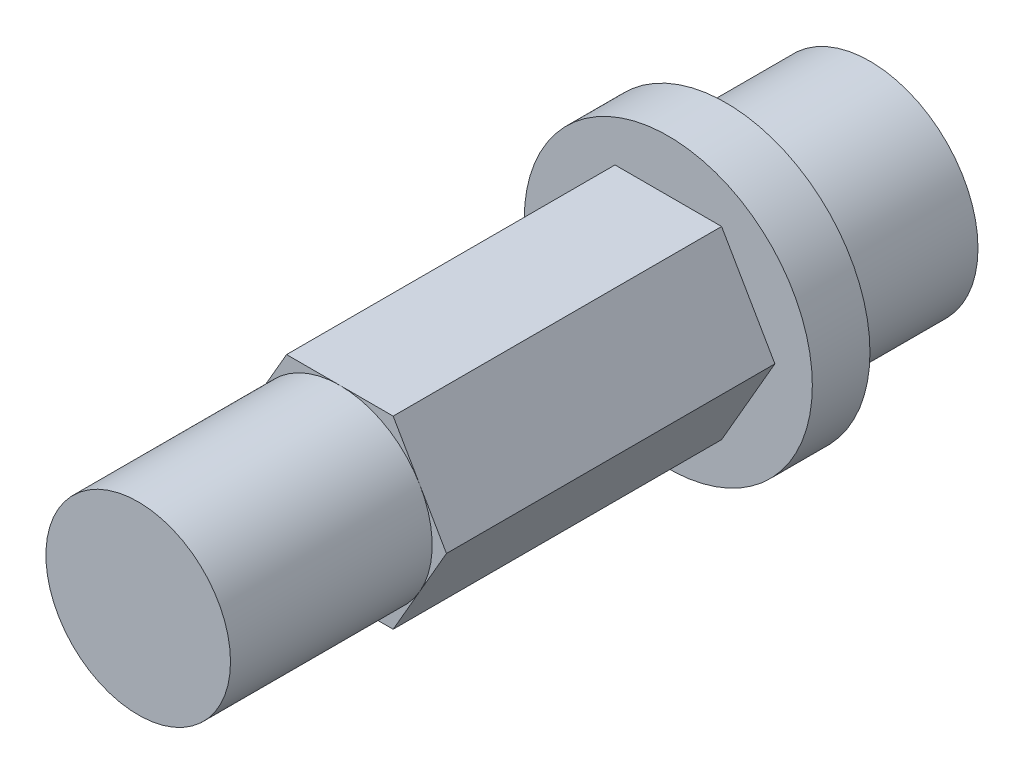
ISO-10303-21;
HEADER;
FILE_DESCRIPTION(('STEP AP214'),'2;1');
FILE_NAME('part.step','',(''),(''),'','','');
FILE_SCHEMA(('AUTOMOTIVE_DESIGN { 1 0 10303 214 1 1 1 1 }'));
ENDSEC;
DATA;
#1=APPLICATION_CONTEXT('core data for automotive mechanical design processes');
#2=APPLICATION_PROTOCOL_DEFINITION('international standard','automotive_design',2000,#1);
#3=PRODUCT_CONTEXT('',#1,'mechanical');
#4=PRODUCT('Part','Part','',(#3));
#5=PRODUCT_RELATED_PRODUCT_CATEGORY('part','',(#4));
#6=PRODUCT_DEFINITION_FORMATION('','',#4);
#7=PRODUCT_DEFINITION_CONTEXT('part definition',#1,'design');
#8=PRODUCT_DEFINITION('design','',#6,#7);
#9=PRODUCT_DEFINITION_SHAPE('','',#8);
#10=(LENGTH_UNIT() NAMED_UNIT(*) SI_UNIT(.MILLI.,.METRE.));
#11=(NAMED_UNIT(*) PLANE_ANGLE_UNIT() SI_UNIT($,.RADIAN.));
#12=(NAMED_UNIT(*) SI_UNIT($,.STERADIAN.) SOLID_ANGLE_UNIT());
#13=UNCERTAINTY_MEASURE_WITH_UNIT(LENGTH_MEASURE(1.E-05),#10,'distance_accuracy_value','');
#14=(GEOMETRIC_REPRESENTATION_CONTEXT(3) GLOBAL_UNCERTAINTY_ASSIGNED_CONTEXT((#13)) GLOBAL_UNIT_ASSIGNED_CONTEXT((#10,
#11,#12)) REPRESENTATION_CONTEXT('',''));
#15=CARTESIAN_POINT('',(0.,0.,0.));
#16=DIRECTION('',(0.,0.,1.));
#17=DIRECTION('',(1.,0.,0.));
#18=AXIS2_PLACEMENT_3D('',#15,#16,#17);
#19=CARTESIAN_POINT('',(0.,0.,18.4));
#20=DIRECTION('',(0.,0.,1.));
#21=DIRECTION('',(1.,0.,0.));
#22=AXIS2_PLACEMENT_3D('',#19,#20,#21);
#23=PLANE('',#22);
#24=CARTESIAN_POINT('',(0.,0.,18.4));
#25=DIRECTION('',(0.,0.,1.));
#26=DIRECTION('',(1.,0.,0.));
#27=AXIS2_PLACEMENT_3D('',#24,#25,#26);
#28=CIRCLE('',#27,3.20429399400242);
#29=CARTESIAN_POINT('',(2.775,1.60214699700121,18.4));
#30=VERTEX_POINT('',#29);
#31=CARTESIAN_POINT('',(0.,3.20429399400243,18.4));
#32=VERTEX_POINT('',#31);
#33=EDGE_CURVE('E51',#30,#32,#28,.T.);
#34=ORIENTED_EDGE('',*,*,#33,.F.);
#35=DIRECTION('',(-0.5,0.866025403784439,0.));
#36=VECTOR('',#35,1.);
#37=CARTESIAN_POINT('',(3.7,0.,18.4));
#38=LINE('',#37,#36);
#39=CARTESIAN_POINT('',(1.85,3.20429399400242,18.4));
#40=VERTEX_POINT('',#39);
#41=EDGE_CURVE('E127',#30,#40,#38,.T.);
#42=ORIENTED_EDGE('',*,*,#41,.T.);
#43=DIRECTION('',(-1.,0.,0.));
#44=VECTOR('',#43,1.);
#45=CARTESIAN_POINT('',(1.85,3.20429399400242,18.4));
#46=LINE('',#45,#44);
#47=EDGE_CURVE('E141',#40,#32,#46,.T.);
#48=ORIENTED_EDGE('',*,*,#47,.T.);
#49=EDGE_LOOP('',(#34,#42,#48));
#50=FACE_BOUND('',#49,.T.);
#51=ADVANCED_FACE('F39',(#50),#23,.T.);
#52=CARTESIAN_POINT('',(-2.775,1.60214699700121,18.4));
#53=VERTEX_POINT('',#52);
#54=EDGE_CURVE('E11',#32,#53,#28,.T.);
#55=ORIENTED_EDGE('',*,*,#54,.F.);
#56=CARTESIAN_POINT('',(-1.85,3.20429399400243,18.4));
#57=VERTEX_POINT('',#56);
#58=EDGE_CURVE('E126',#32,#57,#46,.T.);
#59=ORIENTED_EDGE('',*,*,#58,.T.);
#60=DIRECTION('',(-0.5,-0.866025403784439,0.));
#61=VECTOR('',#60,1.);
#62=CARTESIAN_POINT('',(-1.85,3.20429399400243,18.4));
#63=LINE('',#62,#61);
#64=EDGE_CURVE('E158',#57,#53,#63,.T.);
#65=ORIENTED_EDGE('',*,*,#64,.T.);
#66=EDGE_LOOP('',(#55,#59,#65));
#67=FACE_BOUND('',#66,.T.);
#68=ADVANCED_FACE('F242',(#67),#23,.T.);
#69=CARTESIAN_POINT('',(-2.775,-1.60214699700121,18.4));
#70=VERTEX_POINT('',#69);
#71=EDGE_CURVE('E49',#53,#70,#28,.T.);
#72=ORIENTED_EDGE('',*,*,#71,.F.);
#73=CARTESIAN_POINT('',(-3.7,0.,18.4));
#74=VERTEX_POINT('',#73);
#75=EDGE_CURVE('E157',#53,#74,#63,.T.);
#76=ORIENTED_EDGE('',*,*,#75,.T.);
#77=DIRECTION('',(0.5,-0.866025403784439,0.));
#78=VECTOR('',#77,1.);
#79=CARTESIAN_POINT('',(-3.7,0.,18.4));
#80=LINE('',#79,#78);
#81=EDGE_CURVE('E163',#74,#70,#80,.T.);
#82=ORIENTED_EDGE('',*,*,#81,.T.);
#83=EDGE_LOOP('',(#72,#76,#82));
#84=FACE_BOUND('',#83,.T.);
#85=ADVANCED_FACE('F247',(#84),#23,.T.);
#86=CARTESIAN_POINT('',(0.,-3.20429399400242,18.4));
#87=VERTEX_POINT('',#86);
#88=EDGE_CURVE('E66',#70,#87,#28,.T.);
#89=ORIENTED_EDGE('',*,*,#88,.F.);
#90=CARTESIAN_POINT('',(-1.85,-3.20429399400242,18.4));
#91=VERTEX_POINT('',#90);
#92=EDGE_CURVE('E162',#70,#91,#80,.T.);
#93=ORIENTED_EDGE('',*,*,#92,.T.);
#94=DIRECTION('',(1.,0.,0.));
#95=VECTOR('',#94,1.);
#96=CARTESIAN_POINT('',(-1.85,-3.20429399400242,18.4));
#97=LINE('',#96,#95);
#98=EDGE_CURVE('E168',#91,#87,#97,.T.);
#99=ORIENTED_EDGE('',*,*,#98,.T.);
#100=EDGE_LOOP('',(#89,#93,#99));
#101=FACE_BOUND('',#100,.T.);
#102=ADVANCED_FACE('F263',(#101),#23,.T.);
#103=CARTESIAN_POINT('',(2.775,-1.60214699700121,18.4));
#104=VERTEX_POINT('',#103);
#105=EDGE_CURVE('E58',#87,#104,#28,.T.);
#106=ORIENTED_EDGE('',*,*,#105,.F.);
#107=CARTESIAN_POINT('',(1.85,-3.20429399400243,18.4));
#108=VERTEX_POINT('',#107);
#109=EDGE_CURVE('E167',#87,#108,#97,.T.);
#110=ORIENTED_EDGE('',*,*,#109,.T.);
#111=DIRECTION('',(0.5,0.866025403784439,0.));
#112=VECTOR('',#111,1.);
#113=CARTESIAN_POINT('',(1.85,-3.20429399400243,18.4));
#114=LINE('',#113,#112);
#115=EDGE_CURVE('E139',#108,#104,#114,.T.);
#116=ORIENTED_EDGE('',*,*,#115,.T.);
#117=EDGE_LOOP('',(#106,#110,#116));
#118=FACE_BOUND('',#117,.T.);
#119=ADVANCED_FACE('F253',(#118),#23,.T.);
#120=CARTESIAN_POINT('',(0.,0.,5.));
#121=DIRECTION('',(0.,0.,-1.));
#122=DIRECTION('',(-1.,0.,0.));
#123=AXIS2_PLACEMENT_3D('',#120,#121,#122);
#124=CYLINDRICAL_SURFACE('',#123,3.75);
#125=CARTESIAN_POINT('',(0.,0.,5.));
#126=DIRECTION('',(0.,0.,1.));
#127=DIRECTION('',(1.,0.,0.));
#128=AXIS2_PLACEMENT_3D('',#125,#126,#127);
#129=CIRCLE('',#128,3.75);
#130=CARTESIAN_POINT('',(3.75,0.,5.));
#131=VERTEX_POINT('',#130);
#132=EDGE_CURVE('E147',#131,#131,#129,.T.);
#133=ORIENTED_EDGE('',*,*,#132,.F.);
#134=EDGE_LOOP('',(#133));
#135=FACE_BOUND('',#134,.T.);
#136=CARTESIAN_POINT('',(0.,0.,0.));
#137=DIRECTION('',(0.,0.,1.));
#138=DIRECTION('',(1.,0.,0.));
#139=AXIS2_PLACEMENT_3D('',#136,#137,#138);
#140=CIRCLE('',#139,3.75);
#141=CARTESIAN_POINT('',(3.75,0.,0.));
#142=VERTEX_POINT('',#141);
#143=EDGE_CURVE('E43',#142,#142,#140,.T.);
#144=ORIENTED_EDGE('',*,*,#143,.T.);
#145=EDGE_LOOP('',(#144));
#146=FACE_BOUND('',#145,.T.);
#147=ADVANCED_FACE('F41',(#135,#146),#124,.T.);
#148=CARTESIAN_POINT('',(0.,0.,0.));
#149=DIRECTION('',(0.,0.,1.));
#150=DIRECTION('',(1.,0.,0.));
#151=AXIS2_PLACEMENT_3D('',#148,#149,#150);
#152=PLANE('',#151);
#153=ORIENTED_EDGE('',*,*,#143,.F.);
#154=EDGE_LOOP('',(#153));
#155=FACE_BOUND('',#154,.T.);
#156=ADVANCED_FACE('F268',(#155),#152,.F.);
#157=CARTESIAN_POINT('',(0.,0.,7.));
#158=DIRECTION('',(0.,0.,-1.));
#159=DIRECTION('',(-1.,0.,0.));
#160=AXIS2_PLACEMENT_3D('',#157,#158,#159);
#161=CYLINDRICAL_SURFACE('',#160,5.);
#162=CARTESIAN_POINT('',(0.,0.,7.));
#163=DIRECTION('',(0.,0.,1.));
#164=DIRECTION('',(1.,0.,0.));
#165=AXIS2_PLACEMENT_3D('',#162,#163,#164);
#166=CIRCLE('',#165,5.);
#167=CARTESIAN_POINT('',(5.,0.,7.));
#168=VERTEX_POINT('',#167);
#169=EDGE_CURVE('E216',#168,#168,#166,.T.);
#170=ORIENTED_EDGE('',*,*,#169,.F.);
#171=EDGE_LOOP('',(#170));
#172=FACE_BOUND('',#171,.T.);
#173=CARTESIAN_POINT('',(0.,0.,5.));
#174=DIRECTION('',(0.,0.,1.));
#175=DIRECTION('',(1.,0.,0.));
#176=AXIS2_PLACEMENT_3D('',#173,#174,#175);
#177=CIRCLE('',#176,5.);
#178=CARTESIAN_POINT('',(5.,0.,5.));
#179=VERTEX_POINT('',#178);
#180=EDGE_CURVE('E215',#179,#179,#177,.T.);
#181=ORIENTED_EDGE('',*,*,#180,.T.);
#182=EDGE_LOOP('',(#181));
#183=FACE_BOUND('',#182,.T.);
#184=ADVANCED_FACE('F224',(#172,#183),#161,.T.);
#185=CARTESIAN_POINT('',(0.,0.,7.));
#186=DIRECTION('',(0.,0.,1.));
#187=DIRECTION('',(1.,0.,0.));
#188=AXIS2_PLACEMENT_3D('',#185,#186,#187);
#189=PLANE('',#188);
#190=DIRECTION('',(0.5,0.866025403784439,0.));
#191=VECTOR('',#190,1.);
#192=CARTESIAN_POINT('',(1.85,-3.20429399400243,7.));
#193=LINE('',#192,#191);
#194=CARTESIAN_POINT('',(1.85,-3.20429399400243,7.));
#195=VERTEX_POINT('',#194);
#196=CARTESIAN_POINT('',(3.7,0.,7.));
#197=VERTEX_POINT('',#196);
#198=EDGE_CURVE('E172',#195,#197,#193,.T.);
#199=ORIENTED_EDGE('',*,*,#198,.F.);
#200=DIRECTION('',(1.,0.,0.));
#201=VECTOR('',#200,1.);
#202=CARTESIAN_POINT('',(-1.85,-3.20429399400242,7.));
#203=LINE('',#202,#201);
#204=CARTESIAN_POINT('',(-1.85,-3.20429399400242,7.));
#205=VERTEX_POINT('',#204);
#206=EDGE_CURVE('E191',#205,#195,#203,.T.);
#207=ORIENTED_EDGE('',*,*,#206,.F.);
#208=DIRECTION('',(0.5,-0.866025403784439,0.));
#209=VECTOR('',#208,1.);
#210=CARTESIAN_POINT('',(-3.7,0.,7.));
#211=LINE('',#210,#209);
#212=CARTESIAN_POINT('',(-3.7,0.,7.));
#213=VERTEX_POINT('',#212);
#214=EDGE_CURVE('E187',#213,#205,#211,.T.);
#215=ORIENTED_EDGE('',*,*,#214,.F.);
#216=DIRECTION('',(-0.5,-0.866025403784439,0.));
#217=VECTOR('',#216,1.);
#218=CARTESIAN_POINT('',(-1.85,3.20429399400243,7.));
#219=LINE('',#218,#217);
#220=CARTESIAN_POINT('',(-1.85,3.20429399400243,7.));
#221=VERTEX_POINT('',#220);
#222=EDGE_CURVE('E183',#221,#213,#219,.T.);
#223=ORIENTED_EDGE('',*,*,#222,.F.);
#224=DIRECTION('',(-1.,0.,0.));
#225=VECTOR('',#224,1.);
#226=CARTESIAN_POINT('',(1.85,3.20429399400242,7.));
#227=LINE('',#226,#225);
#228=CARTESIAN_POINT('',(1.85,3.20429399400242,7.));
#229=VERTEX_POINT('',#228);
#230=EDGE_CURVE('E179',#229,#221,#227,.T.);
#231=ORIENTED_EDGE('',*,*,#230,.F.);
#232=DIRECTION('',(-0.5,0.866025403784439,0.));
#233=VECTOR('',#232,1.);
#234=CARTESIAN_POINT('',(3.7,0.,7.));
#235=LINE('',#234,#233);
#236=EDGE_CURVE('E176',#197,#229,#235,.T.);
#237=ORIENTED_EDGE('',*,*,#236,.F.);
#238=EDGE_LOOP('',(#199,#207,#215,#223,#231,#237));
#239=FACE_BOUND('',#238,.T.);
#240=ORIENTED_EDGE('',*,*,#169,.T.);
#241=EDGE_LOOP('',(#240));
#242=FACE_BOUND('',#241,.T.);
#243=ADVANCED_FACE('F229',(#239,#242),#189,.T.);
#244=CARTESIAN_POINT('',(0.,0.,5.));
#245=DIRECTION('',(0.,0.,1.));
#246=DIRECTION('',(1.,0.,0.));
#247=AXIS2_PLACEMENT_3D('',#244,#245,#246);
#248=PLANE('',#247);
#249=ORIENTED_EDGE('',*,*,#132,.T.);
#250=EDGE_LOOP('',(#249));
#251=FACE_BOUND('',#250,.T.);
#252=ORIENTED_EDGE('',*,*,#180,.F.);
#253=EDGE_LOOP('',(#252));
#254=FACE_BOUND('',#253,.T.);
#255=ADVANCED_FACE('F226',(#251,#254),#248,.F.);
#256=CARTESIAN_POINT('',(1.85,-3.20429399400243,18.4));
#257=DIRECTION('',(-0.866025403784439,0.5,0.));
#258=DIRECTION('',(-0.5,-0.866025403784439,0.));
#259=AXIS2_PLACEMENT_3D('',#256,#257,#258);
#260=PLANE('',#259);
#261=ORIENTED_EDGE('',*,*,#198,.T.);
#262=DIRECTION('',(0.,0.,-1.));
#263=VECTOR('',#262,1.);
#264=CARTESIAN_POINT('',(3.7,0.,18.4));
#265=LINE('',#264,#263);
#266=CARTESIAN_POINT('',(3.7,0.,18.4));
#267=VERTEX_POINT('',#266);
#268=EDGE_CURVE('E212',#267,#197,#265,.T.);
#269=ORIENTED_EDGE('',*,*,#268,.F.);
#270=EDGE_CURVE('E121',#104,#267,#114,.T.);
#271=ORIENTED_EDGE('',*,*,#270,.F.);
#272=ORIENTED_EDGE('',*,*,#115,.F.);
#273=DIRECTION('',(0.,0.,-1.));
#274=VECTOR('',#273,1.);
#275=CARTESIAN_POINT('',(1.85,-3.20429399400243,18.4));
#276=LINE('',#275,#274);
#277=EDGE_CURVE('E171',#108,#195,#276,.T.);
#278=ORIENTED_EDGE('',*,*,#277,.T.);
#279=EDGE_LOOP('',(#261,#269,#271,#272,#278));
#280=FACE_BOUND('',#279,.T.);
#281=ADVANCED_FACE('F228',(#280),#260,.F.);
#282=CARTESIAN_POINT('',(3.7,0.,18.4));
#283=DIRECTION('',(-0.866025403784439,-0.5,0.));
#284=DIRECTION('',(0.5,-0.866025403784439,0.));
#285=AXIS2_PLACEMENT_3D('',#282,#283,#284);
#286=PLANE('',#285);
#287=ORIENTED_EDGE('',*,*,#236,.T.);
#288=DIRECTION('',(0.,0.,-1.));
#289=VECTOR('',#288,1.);
#290=CARTESIAN_POINT('',(1.85,3.20429399400242,18.4));
#291=LINE('',#290,#289);
#292=EDGE_CURVE('E134',#40,#229,#291,.T.);
#293=ORIENTED_EDGE('',*,*,#292,.F.);
#294=ORIENTED_EDGE('',*,*,#41,.F.);
#295=EDGE_CURVE('E115',#267,#30,#38,.T.);
#296=ORIENTED_EDGE('',*,*,#295,.F.);
#297=ORIENTED_EDGE('',*,*,#268,.T.);
#298=EDGE_LOOP('',(#287,#293,#294,#296,#297));
#299=FACE_BOUND('',#298,.T.);
#300=ADVANCED_FACE('F132',(#299),#286,.F.);
#301=CARTESIAN_POINT('',(1.85,3.20429399400242,18.4));
#302=DIRECTION('',(0.,-1.,0.));
#303=DIRECTION('',(1.,0.,0.));
#304=AXIS2_PLACEMENT_3D('',#301,#302,#303);
#305=PLANE('',#304);
#306=ORIENTED_EDGE('',*,*,#230,.T.);
#307=DIRECTION('',(0.,0.,-1.));
#308=VECTOR('',#307,1.);
#309=CARTESIAN_POINT('',(-1.85,3.20429399400243,18.4));
#310=LINE('',#309,#308);
#311=EDGE_CURVE('E206',#57,#221,#310,.T.);
#312=ORIENTED_EDGE('',*,*,#311,.F.);
#313=ORIENTED_EDGE('',*,*,#58,.F.);
#314=ORIENTED_EDGE('',*,*,#47,.F.);
#315=ORIENTED_EDGE('',*,*,#292,.T.);
#316=EDGE_LOOP('',(#306,#312,#313,#314,#315));
#317=FACE_BOUND('',#316,.T.);
#318=ADVANCED_FACE('F289',(#317),#305,.F.);
#319=CARTESIAN_POINT('',(-1.85,3.20429399400243,18.4));
#320=DIRECTION('',(0.866025403784439,-0.5,0.));
#321=DIRECTION('',(0.5,0.866025403784439,0.));
#322=AXIS2_PLACEMENT_3D('',#319,#320,#321);
#323=PLANE('',#322);
#324=ORIENTED_EDGE('',*,*,#222,.T.);
#325=DIRECTION('',(0.,0.,-1.));
#326=VECTOR('',#325,1.);
#327=CARTESIAN_POINT('',(-3.7,0.,18.4));
#328=LINE('',#327,#326);
#329=EDGE_CURVE('E202',#74,#213,#328,.T.);
#330=ORIENTED_EDGE('',*,*,#329,.F.);
#331=ORIENTED_EDGE('',*,*,#75,.F.);
#332=ORIENTED_EDGE('',*,*,#64,.F.);
#333=ORIENTED_EDGE('',*,*,#311,.T.);
#334=EDGE_LOOP('',(#324,#330,#331,#332,#333));
#335=FACE_BOUND('',#334,.T.);
#336=ADVANCED_FACE('F283',(#335),#323,.F.);
#337=CARTESIAN_POINT('',(-3.7,0.,18.4));
#338=DIRECTION('',(0.866025403784439,0.5,0.));
#339=DIRECTION('',(-0.5,0.866025403784439,0.));
#340=AXIS2_PLACEMENT_3D('',#337,#338,#339);
#341=PLANE('',#340);
#342=ORIENTED_EDGE('',*,*,#214,.T.);
#343=DIRECTION('',(0.,0.,-1.));
#344=VECTOR('',#343,1.);
#345=CARTESIAN_POINT('',(-1.85,-3.20429399400242,18.4));
#346=LINE('',#345,#344);
#347=EDGE_CURVE('E198',#91,#205,#346,.T.);
#348=ORIENTED_EDGE('',*,*,#347,.F.);
#349=ORIENTED_EDGE('',*,*,#92,.F.);
#350=ORIENTED_EDGE('',*,*,#81,.F.);
#351=ORIENTED_EDGE('',*,*,#329,.T.);
#352=EDGE_LOOP('',(#342,#348,#349,#350,#351));
#353=FACE_BOUND('',#352,.T.);
#354=ADVANCED_FACE('F260',(#353),#341,.F.);
#355=CARTESIAN_POINT('',(-1.85,-3.20429399400242,18.4));
#356=DIRECTION('',(0.,1.,0.));
#357=DIRECTION('',(-1.,0.,0.));
#358=AXIS2_PLACEMENT_3D('',#355,#356,#357);
#359=PLANE('',#358);
#360=ORIENTED_EDGE('',*,*,#206,.T.);
#361=ORIENTED_EDGE('',*,*,#277,.F.);
#362=ORIENTED_EDGE('',*,*,#109,.F.);
#363=ORIENTED_EDGE('',*,*,#98,.F.);
#364=ORIENTED_EDGE('',*,*,#347,.T.);
#365=EDGE_LOOP('',(#360,#361,#362,#363,#364));
#366=FACE_BOUND('',#365,.T.);
#367=ADVANCED_FACE('F252',(#366),#359,.F.);
#368=EDGE_CURVE('E119',#104,#30,#28,.T.);
#369=ORIENTED_EDGE('',*,*,#368,.F.);
#370=ORIENTED_EDGE('',*,*,#270,.T.);
#371=ORIENTED_EDGE('',*,*,#295,.T.);
#372=EDGE_LOOP('',(#369,#370,#371));
#373=FACE_BOUND('',#372,.T.);
#374=ADVANCED_FACE('F117',(#373),#23,.T.);
#375=CARTESIAN_POINT('',(0.,0.,25.4));
#376=DIRECTION('',(0.,0.,-1.));
#377=DIRECTION('',(-1.,0.,0.));
#378=AXIS2_PLACEMENT_3D('',#375,#376,#377);
#379=CYLINDRICAL_SURFACE('',#378,3.20429399400242);
#380=CARTESIAN_POINT('',(0.,0.,25.4));
#381=DIRECTION('',(0.,0.,1.));
#382=DIRECTION('',(1.,0.,0.));
#383=AXIS2_PLACEMENT_3D('',#380,#381,#382);
#384=CIRCLE('',#383,3.20429399400242);
#385=CARTESIAN_POINT('',(3.20429399400242,0.,25.4));
#386=VERTEX_POINT('',#385);
#387=EDGE_CURVE('E144',#386,#386,#384,.T.);
#388=ORIENTED_EDGE('',*,*,#387,.F.);
#389=EDGE_LOOP('',(#388));
#390=FACE_BOUND('',#389,.T.);
#391=ORIENTED_EDGE('',*,*,#33,.T.);
#392=ORIENTED_EDGE('',*,*,#54,.T.);
#393=ORIENTED_EDGE('',*,*,#71,.T.);
#394=ORIENTED_EDGE('',*,*,#88,.T.);
#395=ORIENTED_EDGE('',*,*,#105,.T.);
#396=ORIENTED_EDGE('',*,*,#368,.T.);
#397=EDGE_LOOP('',(#391,#392,#393,#394,#395,#396));
#398=FACE_BOUND('',#397,.T.);
#399=ADVANCED_FACE('F145',(#390,#398),#379,.T.);
#400=CARTESIAN_POINT('',(0.,0.,25.4));
#401=DIRECTION('',(0.,0.,1.));
#402=DIRECTION('',(1.,0.,0.));
#403=AXIS2_PLACEMENT_3D('',#400,#401,#402);
#404=PLANE('',#403);
#405=ORIENTED_EDGE('',*,*,#387,.T.);
#406=EDGE_LOOP('',(#405));
#407=FACE_BOUND('',#406,.T.);
#408=ADVANCED_FACE('F258',(#407),#404,.T.);
#409=CLOSED_SHELL('',(#51,#68,#85,#102,#119,#147,#156,#184,#243,#255,#281,#300,#318,#336,#354,
#367,#374,#399,#408));
#410=MANIFOLD_SOLID_BREP('B2',#409);
#411=ADVANCED_BREP_SHAPE_REPRESENTATION('',(#18,#410),#14);
#412=SHAPE_DEFINITION_REPRESENTATION(#9,#411);
ENDSEC;
END-ISO-10303-21;
